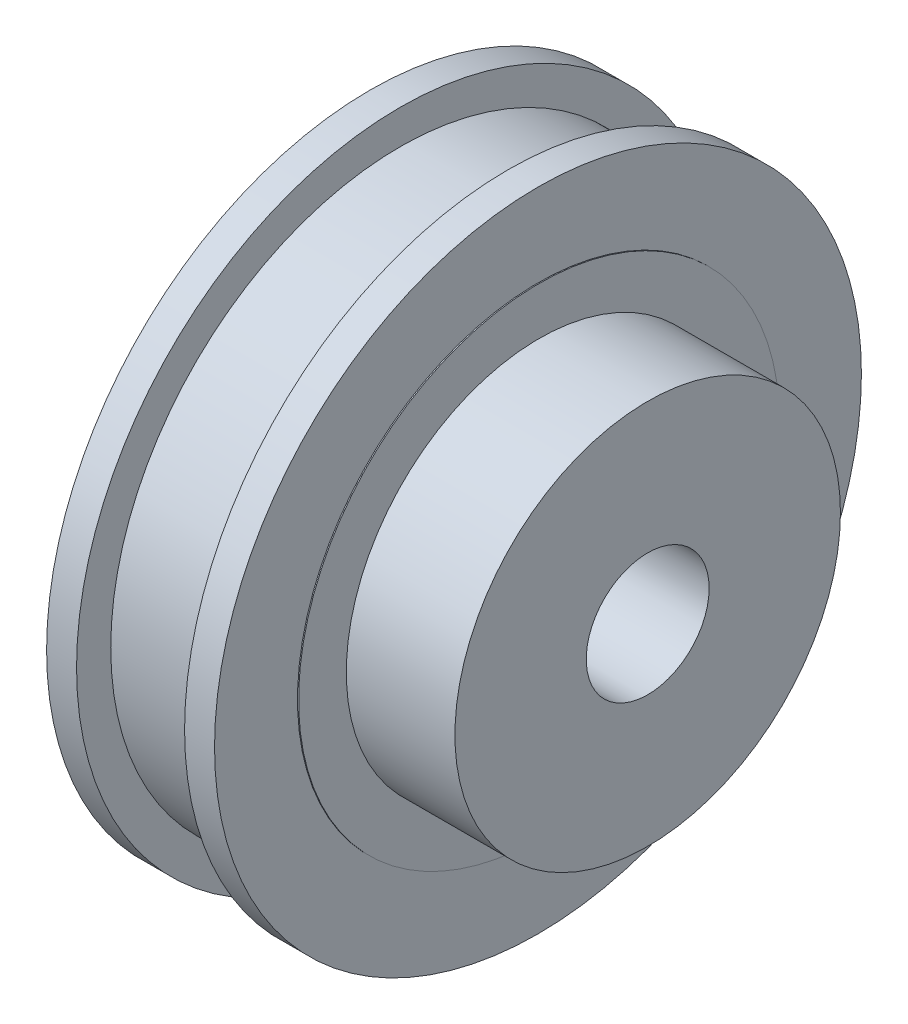
ISO-10303-21;
HEADER;
FILE_DESCRIPTION(('STEP AP214'),'2;1');
FILE_NAME('part.step','',(''),(''),'','','');
FILE_SCHEMA(('AUTOMOTIVE_DESIGN { 1 0 10303 214 1 1 1 1 }'));
ENDSEC;
DATA;
#1=APPLICATION_CONTEXT('core data for automotive mechanical design processes');
#2=APPLICATION_PROTOCOL_DEFINITION('international standard','automotive_design',2000,#1);
#3=PRODUCT_CONTEXT('',#1,'mechanical');
#4=PRODUCT('Part','Part','',(#3));
#5=PRODUCT_RELATED_PRODUCT_CATEGORY('part','',(#4));
#6=PRODUCT_DEFINITION_FORMATION('','',#4);
#7=PRODUCT_DEFINITION_CONTEXT('part definition',#1,'design');
#8=PRODUCT_DEFINITION('design','',#6,#7);
#9=PRODUCT_DEFINITION_SHAPE('','',#8);
#10=(LENGTH_UNIT() NAMED_UNIT(*) SI_UNIT(.MILLI.,.METRE.));
#11=(NAMED_UNIT(*) PLANE_ANGLE_UNIT() SI_UNIT($,.RADIAN.));
#12=(NAMED_UNIT(*) SI_UNIT($,.STERADIAN.) SOLID_ANGLE_UNIT());
#13=UNCERTAINTY_MEASURE_WITH_UNIT(LENGTH_MEASURE(1.E-05),#10,'distance_accuracy_value','');
#14=(GEOMETRIC_REPRESENTATION_CONTEXT(3) GLOBAL_UNCERTAINTY_ASSIGNED_CONTEXT((#13)) GLOBAL_UNIT_ASSIGNED_CONTEXT((#10,
#11,#12)) REPRESENTATION_CONTEXT('',''));
#15=CARTESIAN_POINT('',(0.,0.,0.));
#16=DIRECTION('',(0.,0.,1.));
#17=DIRECTION('',(1.,0.,0.));
#18=AXIS2_PLACEMENT_3D('',#15,#16,#17);
#19=CARTESIAN_POINT('',(10.93,0.,0.));
#20=DIRECTION('',(-1.,0.,0.));
#21=DIRECTION('',(0.,0.,1.));
#22=AXIS2_PLACEMENT_3D('',#19,#20,#21);
#23=CYLINDRICAL_SURFACE('',#22,21.05);
#24=CARTESIAN_POINT('',(0.,0.,0.));
#25=DIRECTION('',(1.,0.,0.));
#26=DIRECTION('',(0.,0.,-1.));
#27=AXIS2_PLACEMENT_3D('',#24,#25,#26);
#28=CIRCLE('',#27,21.05);
#29=CARTESIAN_POINT('',(0.,0.,-21.05));
#30=VERTEX_POINT('',#29);
#31=EDGE_CURVE('E55',#30,#30,#28,.T.);
#32=ORIENTED_EDGE('',*,*,#31,.T.);
#33=EDGE_LOOP('',(#32));
#34=FACE_BOUND('',#33,.T.);
#35=CARTESIAN_POINT('',(1.95,0.,0.));
#36=DIRECTION('',(-1.,0.,0.));
#37=DIRECTION('',(0.,0.,1.));
#38=AXIS2_PLACEMENT_3D('',#35,#36,#37);
#39=CIRCLE('',#38,21.05);
#40=CARTESIAN_POINT('',(1.95,0.,21.05));
#41=VERTEX_POINT('',#40);
#42=EDGE_CURVE('E70',#41,#41,#39,.T.);
#43=ORIENTED_EDGE('',*,*,#42,.T.);
#44=EDGE_LOOP('',(#43));
#45=FACE_BOUND('',#44,.T.);
#46=ADVANCED_FACE('F38',(#34,#45),#23,.T.);
#47=CARTESIAN_POINT('',(0.,0.,0.));
#48=DIRECTION('',(1.,0.,0.));
#49=DIRECTION('',(0.,0.,-1.));
#50=AXIS2_PLACEMENT_3D('',#47,#48,#49);
#51=PLANE('',#50);
#52=CARTESIAN_POINT('',(0.,0.,0.));
#53=DIRECTION('',(1.,0.,0.));
#54=DIRECTION('',(0.,0.,-1.));
#55=AXIS2_PLACEMENT_3D('',#52,#53,#54);
#56=CIRCLE('',#55,15.65);
#57=CARTESIAN_POINT('',(0.,0.,-15.65));
#58=VERTEX_POINT('',#57);
#59=EDGE_CURVE('E10',#58,#58,#56,.F.);
#60=ORIENTED_EDGE('',*,*,#59,.F.);
#61=EDGE_LOOP('',(#60));
#62=FACE_BOUND('',#61,.T.);
#63=ORIENTED_EDGE('',*,*,#31,.F.);
#64=EDGE_LOOP('',(#63));
#65=FACE_BOUND('',#64,.T.);
#66=ADVANCED_FACE('F128',(#62,#65),#51,.F.);
#67=CARTESIAN_POINT('',(-0.0700000000000006,0.,0.));
#68=DIRECTION('',(1.,0.,0.));
#69=DIRECTION('',(0.,0.,1.));
#70=AXIS2_PLACEMENT_3D('',#67,#68,#69);
#71=CYLINDRICAL_SURFACE('',#70,15.65);
#72=CARTESIAN_POINT('',(-0.0700000000000006,0.,0.));
#73=DIRECTION('',(1.,0.,0.));
#74=DIRECTION('',(0.,0.,-1.));
#75=AXIS2_PLACEMENT_3D('',#72,#73,#74);
#76=CIRCLE('',#75,15.65);
#77=CARTESIAN_POINT('',(-0.0700000000000006,0.,-15.65));
#78=VERTEX_POINT('',#77);
#79=EDGE_CURVE('E66',#78,#78,#76,.T.);
#80=ORIENTED_EDGE('',*,*,#79,.T.);
#81=EDGE_LOOP('',(#80));
#82=FACE_BOUND('',#81,.T.);
#83=ORIENTED_EDGE('',*,*,#59,.T.);
#84=EDGE_LOOP('',(#83));
#85=FACE_BOUND('',#84,.T.);
#86=ADVANCED_FACE('F133',(#82,#85),#71,.T.);
#87=CARTESIAN_POINT('',(-0.0700000000000006,0.,0.));
#88=DIRECTION('',(-1.,0.,0.));
#89=DIRECTION('',(0.,0.,-1.));
#90=AXIS2_PLACEMENT_3D('',#87,#88,#89);
#91=PLANE('',#90);
#92=CARTESIAN_POINT('',(-0.0700000000000006,0.,0.));
#93=DIRECTION('',(1.,0.,0.));
#94=DIRECTION('',(0.,0.,-1.));
#95=AXIS2_PLACEMENT_3D('',#92,#93,#94);
#96=CIRCLE('',#95,4.);
#97=CARTESIAN_POINT('',(-0.0700000000000006,0.,-4.));
#98=VERTEX_POINT('',#97);
#99=EDGE_CURVE('E90',#98,#98,#96,.T.);
#100=ORIENTED_EDGE('',*,*,#99,.T.);
#101=EDGE_LOOP('',(#100));
#102=FACE_BOUND('',#101,.T.);
#103=ORIENTED_EDGE('',*,*,#79,.F.);
#104=EDGE_LOOP('',(#103));
#105=FACE_BOUND('',#104,.T.);
#106=ADVANCED_FACE('F100',(#102,#105),#91,.T.);
#107=CARTESIAN_POINT('',(1.95,18.825,0.));
#108=DIRECTION('',(1.,0.,0.));
#109=DIRECTION('',(0.,0.,-1.));
#110=AXIS2_PLACEMENT_3D('',#107,#108,#109);
#111=PLANE('',#110);
#112=CARTESIAN_POINT('',(1.95,0.,0.));
#113=DIRECTION('',(-1.,0.,0.));
#114=DIRECTION('',(0.,0.,1.));
#115=AXIS2_PLACEMENT_3D('',#112,#113,#114);
#116=CIRCLE('',#115,18.825);
#117=CARTESIAN_POINT('',(1.95,0.,18.825));
#118=VERTEX_POINT('',#117);
#119=EDGE_CURVE('E82',#118,#118,#116,.T.);
#120=ORIENTED_EDGE('',*,*,#119,.T.);
#121=EDGE_LOOP('',(#120));
#122=FACE_BOUND('',#121,.T.);
#123=ORIENTED_EDGE('',*,*,#42,.F.);
#124=EDGE_LOOP('',(#123));
#125=FACE_BOUND('',#124,.T.);
#126=ADVANCED_FACE('F139',(#122,#125),#111,.T.);
#127=CARTESIAN_POINT('',(8.98,18.825,0.));
#128=DIRECTION('',(-1.,0.,0.));
#129=DIRECTION('',(0.,0.,1.));
#130=AXIS2_PLACEMENT_3D('',#127,#128,#129);
#131=PLANE('',#130);
#132=CARTESIAN_POINT('',(8.98,0.,0.));
#133=DIRECTION('',(-1.,0.,0.));
#134=DIRECTION('',(0.,0.,1.));
#135=AXIS2_PLACEMENT_3D('',#132,#133,#134);
#136=CIRCLE('',#135,21.05);
#137=CARTESIAN_POINT('',(8.98,0.,21.05));
#138=VERTEX_POINT('',#137);
#139=EDGE_CURVE('E74',#138,#138,#136,.T.);
#140=ORIENTED_EDGE('',*,*,#139,.T.);
#141=EDGE_LOOP('',(#140));
#142=FACE_BOUND('',#141,.T.);
#143=CARTESIAN_POINT('',(8.98,0.,0.));
#144=DIRECTION('',(-1.,0.,0.));
#145=DIRECTION('',(0.,0.,1.));
#146=AXIS2_PLACEMENT_3D('',#143,#144,#145);
#147=CIRCLE('',#146,18.825);
#148=CARTESIAN_POINT('',(8.98,0.,18.825));
#149=VERTEX_POINT('',#148);
#150=EDGE_CURVE('E78',#149,#149,#147,.T.);
#151=ORIENTED_EDGE('',*,*,#150,.F.);
#152=EDGE_LOOP('',(#151));
#153=FACE_BOUND('',#152,.T.);
#154=ADVANCED_FACE('F141',(#142,#153),#131,.T.);
#155=CARTESIAN_POINT('',(0.,0.,0.));
#156=DIRECTION('',(-1.,0.,0.));
#157=DIRECTION('',(0.,0.,1.));
#158=AXIS2_PLACEMENT_3D('',#155,#156,#157);
#159=CYLINDRICAL_SURFACE('',#158,18.825);
#160=ORIENTED_EDGE('',*,*,#150,.T.);
#161=EDGE_LOOP('',(#160));
#162=FACE_BOUND('',#161,.T.);
#163=ORIENTED_EDGE('',*,*,#119,.F.);
#164=EDGE_LOOP('',(#163));
#165=FACE_BOUND('',#164,.T.);
#166=ADVANCED_FACE('F148',(#162,#165),#159,.T.);
#167=CARTESIAN_POINT('',(11.,0.,0.));
#168=DIRECTION('',(1.,0.,0.));
#169=DIRECTION('',(0.,0.,-1.));
#170=AXIS2_PLACEMENT_3D('',#167,#168,#169);
#171=PLANE('',#170);
#172=CARTESIAN_POINT('',(11.,0.,0.));
#173=DIRECTION('',(1.,0.,0.));
#174=DIRECTION('',(0.,0.,-1.));
#175=AXIS2_PLACEMENT_3D('',#172,#173,#174);
#176=CIRCLE('',#175,12.545);
#177=CARTESIAN_POINT('',(11.,0.,-12.545));
#178=VERTEX_POINT('',#177);
#179=EDGE_CURVE('E41',#178,#178,#176,.F.);
#180=ORIENTED_EDGE('',*,*,#179,.T.);
#181=EDGE_LOOP('',(#180));
#182=FACE_BOUND('',#181,.T.);
#183=CARTESIAN_POINT('',(11.,0.,0.));
#184=DIRECTION('',(1.,0.,0.));
#185=DIRECTION('',(0.,0.,-1.));
#186=AXIS2_PLACEMENT_3D('',#183,#184,#185);
#187=CIRCLE('',#186,15.65);
#188=CARTESIAN_POINT('',(11.,0.,-15.65));
#189=VERTEX_POINT('',#188);
#190=EDGE_CURVE('E59',#189,#189,#187,.T.);
#191=ORIENTED_EDGE('',*,*,#190,.T.);
#192=EDGE_LOOP('',(#191));
#193=FACE_BOUND('',#192,.T.);
#194=ADVANCED_FACE('F156',(#182,#193),#171,.T.);
#195=CARTESIAN_POINT('',(11.,0.,0.));
#196=DIRECTION('',(-1.,0.,0.));
#197=DIRECTION('',(0.,0.,1.));
#198=AXIS2_PLACEMENT_3D('',#195,#196,#197);
#199=CYLINDRICAL_SURFACE('',#198,15.65);
#200=ORIENTED_EDGE('',*,*,#190,.F.);
#201=EDGE_LOOP('',(#200));
#202=FACE_BOUND('',#201,.T.);
#203=CARTESIAN_POINT('',(10.93,0.,0.));
#204=DIRECTION('',(1.,0.,0.));
#205=DIRECTION('',(0.,0.,-1.));
#206=AXIS2_PLACEMENT_3D('',#203,#204,#205);
#207=CIRCLE('',#206,15.65);
#208=CARTESIAN_POINT('',(10.93,0.,-15.65));
#209=VERTEX_POINT('',#208);
#210=EDGE_CURVE('E46',#209,#209,#207,.T.);
#211=ORIENTED_EDGE('',*,*,#210,.T.);
#212=EDGE_LOOP('',(#211));
#213=FACE_BOUND('',#212,.T.);
#214=ADVANCED_FACE('F159',(#202,#213),#199,.T.);
#215=CARTESIAN_POINT('',(10.93,0.,0.));
#216=DIRECTION('',(1.,0.,0.));
#217=DIRECTION('',(0.,0.,-1.));
#218=AXIS2_PLACEMENT_3D('',#215,#216,#217);
#219=PLANE('',#218);
#220=ORIENTED_EDGE('',*,*,#210,.F.);
#221=EDGE_LOOP('',(#220));
#222=FACE_BOUND('',#221,.T.);
#223=CARTESIAN_POINT('',(10.93,0.,0.));
#224=DIRECTION('',(1.,0.,0.));
#225=DIRECTION('',(0.,0.,-1.));
#226=AXIS2_PLACEMENT_3D('',#223,#224,#225);
#227=CIRCLE('',#226,21.05);
#228=CARTESIAN_POINT('',(10.93,0.,-21.05));
#229=VERTEX_POINT('',#228);
#230=EDGE_CURVE('E52',#229,#229,#227,.T.);
#231=ORIENTED_EDGE('',*,*,#230,.T.);
#232=EDGE_LOOP('',(#231));
#233=FACE_BOUND('',#232,.T.);
#234=ADVANCED_FACE('F123',(#222,#233),#219,.T.);
#235=ORIENTED_EDGE('',*,*,#230,.F.);
#236=EDGE_LOOP('',(#235));
#237=FACE_BOUND('',#236,.T.);
#238=ORIENTED_EDGE('',*,*,#139,.F.);
#239=EDGE_LOOP('',(#238));
#240=FACE_BOUND('',#239,.T.);
#241=ADVANCED_FACE('F117',(#237,#240),#23,.T.);
#242=CARTESIAN_POINT('',(18.07,0.,0.));
#243=DIRECTION('',(-1.,0.,0.));
#244=DIRECTION('',(0.,0.,1.));
#245=AXIS2_PLACEMENT_3D('',#242,#243,#244);
#246=CYLINDRICAL_SURFACE('',#245,12.545);
#247=ORIENTED_EDGE('',*,*,#179,.F.);
#248=EDGE_LOOP('',(#247));
#249=FACE_BOUND('',#248,.T.);
#250=CARTESIAN_POINT('',(18.07,0.,0.));
#251=DIRECTION('',(1.,0.,0.));
#252=DIRECTION('',(0.,0.,-1.));
#253=AXIS2_PLACEMENT_3D('',#250,#251,#252);
#254=CIRCLE('',#253,12.545);
#255=CARTESIAN_POINT('',(18.07,0.,-12.545));
#256=VERTEX_POINT('',#255);
#257=EDGE_CURVE('E86',#256,#256,#254,.T.);
#258=ORIENTED_EDGE('',*,*,#257,.F.);
#259=EDGE_LOOP('',(#258));
#260=FACE_BOUND('',#259,.T.);
#261=ADVANCED_FACE('F112',(#249,#260),#246,.T.);
#262=CARTESIAN_POINT('',(18.07,0.,0.));
#263=DIRECTION('',(1.,0.,0.));
#264=DIRECTION('',(0.,0.,-1.));
#265=AXIS2_PLACEMENT_3D('',#262,#263,#264);
#266=PLANE('',#265);
#267=CARTESIAN_POINT('',(18.07,0.,0.));
#268=DIRECTION('',(1.,0.,0.));
#269=DIRECTION('',(0.,0.,-1.));
#270=AXIS2_PLACEMENT_3D('',#267,#268,#269);
#271=CIRCLE('',#270,4.);
#272=CARTESIAN_POINT('',(18.07,0.,-4.));
#273=VERTEX_POINT('',#272);
#274=EDGE_CURVE('E91',#273,#273,#271,.T.);
#275=ORIENTED_EDGE('',*,*,#274,.F.);
#276=EDGE_LOOP('',(#275));
#277=FACE_BOUND('',#276,.T.);
#278=ORIENTED_EDGE('',*,*,#257,.T.);
#279=EDGE_LOOP('',(#278));
#280=FACE_BOUND('',#279,.T.);
#281=ADVANCED_FACE('F106',(#277,#280),#266,.T.);
#282=CARTESIAN_POINT('',(-0.0700000000000006,0.,0.));
#283=DIRECTION('',(1.,0.,0.));
#284=DIRECTION('',(0.,0.,-1.));
#285=AXIS2_PLACEMENT_3D('',#282,#283,#284);
#286=CYLINDRICAL_SURFACE('',#285,4.);
#287=ORIENTED_EDGE('',*,*,#99,.F.);
#288=EDGE_LOOP('',(#287));
#289=FACE_BOUND('',#288,.T.);
#290=ORIENTED_EDGE('',*,*,#274,.T.);
#291=EDGE_LOOP('',(#290));
#292=FACE_BOUND('',#291,.T.);
#293=ADVANCED_FACE('F103',(#289,#292),#286,.F.);
#294=CLOSED_SHELL('',(#46,#66,#86,#106,#126,#154,#166,#194,#214,#234,#241,#261,#281,#293));
#295=MANIFOLD_SOLID_BREP('B2',#294);
#296=ADVANCED_BREP_SHAPE_REPRESENTATION('',(#18,#295),#14);
#297=SHAPE_DEFINITION_REPRESENTATION(#9,#296);
ENDSEC;
END-ISO-10303-21;
